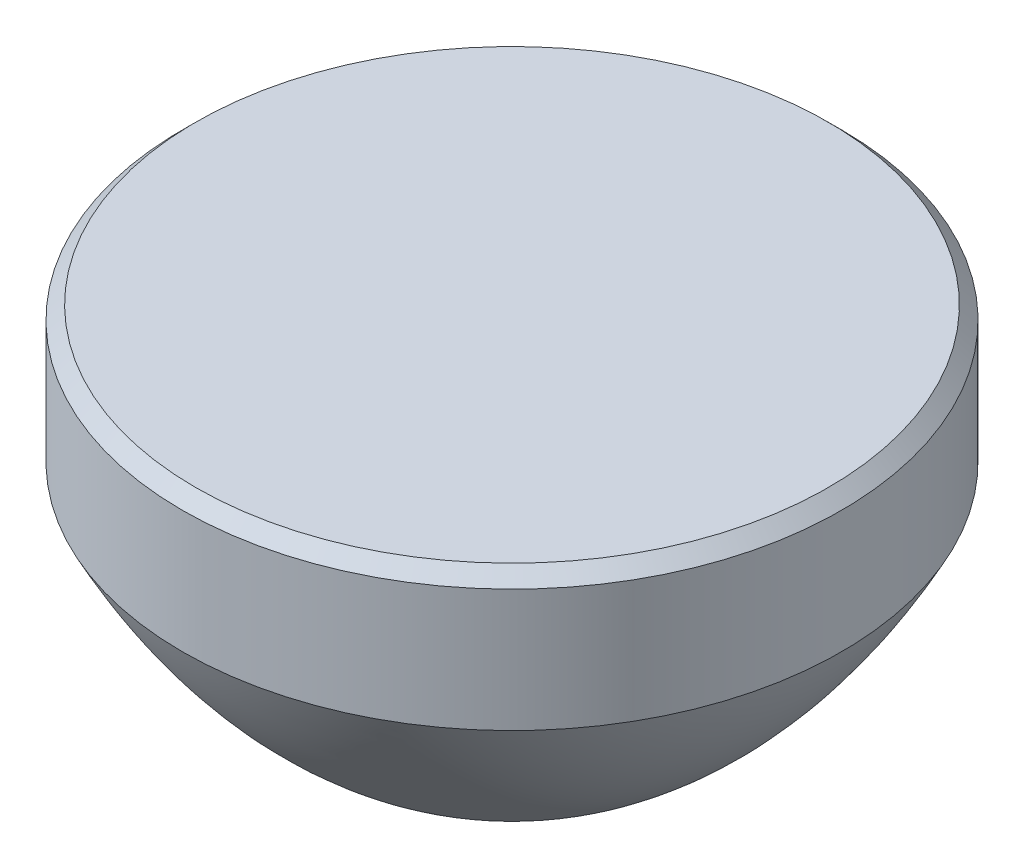
ISO-10303-21;
HEADER;
FILE_DESCRIPTION(('STEP AP214'),'2;1');
FILE_NAME('part.step','',(''),(''),'','','');
FILE_SCHEMA(('AUTOMOTIVE_DESIGN { 1 0 10303 214 1 1 1 1 }'));
ENDSEC;
DATA;
#1=APPLICATION_CONTEXT('core data for automotive mechanical design processes');
#2=APPLICATION_PROTOCOL_DEFINITION('international standard','automotive_design',2000,#1);
#3=PRODUCT_CONTEXT('',#1,'mechanical');
#4=PRODUCT('Part','Part','',(#3));
#5=PRODUCT_RELATED_PRODUCT_CATEGORY('part','',(#4));
#6=PRODUCT_DEFINITION_FORMATION('','',#4);
#7=PRODUCT_DEFINITION_CONTEXT('part definition',#1,'design');
#8=PRODUCT_DEFINITION('design','',#6,#7);
#9=PRODUCT_DEFINITION_SHAPE('','',#8);
#10=(LENGTH_UNIT() NAMED_UNIT(*) SI_UNIT(.MILLI.,.METRE.));
#11=(NAMED_UNIT(*) PLANE_ANGLE_UNIT() SI_UNIT($,.RADIAN.));
#12=(NAMED_UNIT(*) SI_UNIT($,.STERADIAN.) SOLID_ANGLE_UNIT());
#13=UNCERTAINTY_MEASURE_WITH_UNIT(LENGTH_MEASURE(1.E-05),#10,'distance_accuracy_value','');
#14=(GEOMETRIC_REPRESENTATION_CONTEXT(3) GLOBAL_UNCERTAINTY_ASSIGNED_CONTEXT((#13)) GLOBAL_UNIT_ASSIGNED_CONTEXT((#10,
#11,#12)) REPRESENTATION_CONTEXT('',''));
#15=CARTESIAN_POINT('',(0.,0.,0.));
#16=DIRECTION('',(0.,0.,1.));
#17=DIRECTION('',(1.,0.,0.));
#18=AXIS2_PLACEMENT_3D('',#15,#16,#17);
#19=CARTESIAN_POINT('',(0.,-2.9,0.));
#20=CARTESIAN_POINT('',(0.,-2.9,0.047771163554872));
#21=CARTESIAN_POINT('',(0.,-2.89849209528738,0.119832677684458));
#22=CARTESIAN_POINT('',(0.,-2.89346578990156,0.268426532367459));
#23=CARTESIAN_POINT('',(0.,-2.87992592184067,0.412434553279759));
#24=CARTESIAN_POINT('',(0.,-2.86041756065513,0.59354576037228));
#25=CARTESIAN_POINT('',(0.,-2.82904236431794,0.778868341411304));
#26=CARTESIAN_POINT('',(0.,-2.78161447398149,1.00389034921256));
#27=CARTESIAN_POINT('',(0.,-2.72292300141543,1.21782201166675));
#28=CARTESIAN_POINT('',(0.,-2.65334646240165,1.43336411531343));
#29=CARTESIAN_POINT('',(0.,-2.57329708391877,1.64230861469053));
#30=CARTESIAN_POINT('',(0.,-2.48325509982383,1.84889778409511));
#31=CARTESIAN_POINT('',(0.,-2.38368470455536,2.05001137937612));
#32=CARTESIAN_POINT('',(0.,-2.27514410985079,2.24703596465773));
#33=CARTESIAN_POINT('',(0.,-2.15807751142553,2.43877869041615));
#34=CARTESIAN_POINT('',(0.,-2.03313112887913,2.6256123202582));
#35=CARTESIAN_POINT('',(0.,-1.89224448805126,2.81865742006257));
#36=CARTESIAN_POINT('',(0.,-1.70857964405639,3.04954464069177));
#37=CARTESIAN_POINT('',(0.,-1.47533146881389,3.31278656640467));
#38=CARTESIAN_POINT('',(0.,-1.22739488274067,3.56117402073418));
#39=CARTESIAN_POINT('',(0.,-0.976185853238921,3.78718897928286));
#40=CARTESIAN_POINT('',(0.,-0.761332145445054,3.96629889805296));
#41=CARTESIAN_POINT('',(0.,-0.582742331207921,4.10606657833552));
#42=CARTESIAN_POINT('',(0.,-0.36097806646885,4.27160880502101));
#43=CARTESIAN_POINT('',(0.,-0.122943668397963,4.43481331641648));
#44=CARTESIAN_POINT('',(0.,0.10219728821653,4.58117593407208));
#45=CARTESIAN_POINT('',(0.,0.358696942203526,4.73423425094103));
#46=CARTESIAN_POINT('',(0.,0.526029168427437,4.83149914296394));
#47=CARTESIAN_POINT('',(0.,0.713916241579733,4.93283548258424));
#48=CARTESIAN_POINT('',(0.,0.799309135773187,4.97799387695552));
#49=CARTESIAN_POINT('',(0.,0.841709852713762,5.00000000000096));
#50=B_SPLINE_CURVE_WITH_KNOTS('',4,(#19,#20,#21,#22,#23,#24,#25,#26,#27,#28,#29,#30,#31,#32,#33,
#34,#35,#36,#37,#38,#39,#40,#41,#42,#43,#44,#45,#46,#47,#48,#49),.UNSPECIFIED.,.F.,.F.,(5,1,1,1,
1,1,1,1,1,1,1,1,1,1,1,1,1,1,1,1,1,1,1,1,1,1,1,5),(0.0648541245587119,0.0939274464039233,
0.108464104667884,0.123000762931845,0.152074093928852,0.181147410452886,0.210220714745704,
0.23929403000449,0.268367363288725,0.297440655355653,0.326513984002242,0.355587303660881,
0.384660605543354,0.413733898906283,0.442807212779115,0.471880576276969,0.508307684173329,
0.566454253417063,0.624600959988645,0.65367422681223,0.682747493635816,0.711820894025282,
0.740894294414747,0.799040815281995,0.828114175997417,0.857187536712839,0.886260897931253,
0.915334259149666),.UNSPECIFIED.);
#51=CARTESIAN_POINT('',(0.,-2.9,0.));
#52=DIRECTION('',(0.,-1.,0.));
#53=AXIS1_PLACEMENT('',#51,#52);
#54=SURFACE_OF_REVOLUTION('',#50,#53);
#55=CARTESIAN_POINT('',(0.,0.841709852713398,0.));
#56=DIRECTION('',(0.,-1.,0.));
#57=DIRECTION('',(0.,0.,-1.));
#58=AXIS2_PLACEMENT_3D('',#55,#56,#57);
#59=CIRCLE('',#58,5.0000000000014);
#60=CARTESIAN_POINT('',(0.,0.841709852713398,-5.0000000000014));
#61=VERTEX_POINT('',#60);
#62=EDGE_CURVE('E43',#61,#61,#59,.T.);
#63=ORIENTED_EDGE('',*,*,#62,.T.);
#64=EDGE_LOOP('',(#63));
#65=FACE_BOUND('',#64,.T.);
#66=CARTESIAN_POINT('',(0.,-2.9,0.));
#67=VERTEX_POINT('',#66);
#68=VERTEX_LOOP('',#67);
#69=FACE_BOUND('',#68,.T.);
#70=ADVANCED_FACE('F16',(#65,#69),#54,.F.);
#71=CARTESIAN_POINT('',(0.,2.9,5.0000000000014));
#72=DIRECTION('',(0.,1.,0.));
#73=DIRECTION('',(0.,0.,1.));
#74=AXIS2_PLACEMENT_3D('',#71,#72,#73);
#75=PLANE('',#74);
#76=CARTESIAN_POINT('',(0.,2.9,0.));
#77=DIRECTION('',(0.,1.,0.));
#78=DIRECTION('',(0.,0.,1.));
#79=AXIS2_PLACEMENT_3D('',#76,#77,#78);
#80=CIRCLE('',#79,4.8000000000014);
#81=CARTESIAN_POINT('',(0.,2.9,4.8000000000014));
#82=VERTEX_POINT('',#81);
#83=EDGE_CURVE('E11',#82,#82,#80,.T.);
#84=ORIENTED_EDGE('',*,*,#83,.T.);
#85=EDGE_LOOP('',(#84));
#86=FACE_BOUND('',#85,.T.);
#87=ADVANCED_FACE('F27',(#86),#75,.T.);
#88=CARTESIAN_POINT('',(0.,-2.9,0.));
#89=DIRECTION('',(0.,-1.,0.));
#90=DIRECTION('',(0.,0.,-1.));
#91=AXIS2_PLACEMENT_3D('',#88,#89,#90);
#92=CYLINDRICAL_SURFACE('',#91,5.0000000000014);
#93=CARTESIAN_POINT('',(0.,2.7,0.));
#94=DIRECTION('',(0.,1.,0.));
#95=DIRECTION('',(0.,0.,1.));
#96=AXIS2_PLACEMENT_3D('',#93,#94,#95);
#97=CIRCLE('',#96,5.0000000000014);
#98=CARTESIAN_POINT('',(0.,2.7,5.0000000000014));
#99=VERTEX_POINT('',#98);
#100=EDGE_CURVE('E23',#99,#99,#97,.F.);
#101=ORIENTED_EDGE('',*,*,#100,.T.);
#102=EDGE_LOOP('',(#101));
#103=FACE_BOUND('',#102,.T.);
#104=ORIENTED_EDGE('',*,*,#62,.F.);
#105=EDGE_LOOP('',(#104));
#106=FACE_BOUND('',#105,.T.);
#107=ADVANCED_FACE('F33',(#103,#106),#92,.T.);
#108=CARTESIAN_POINT('',(0.,2.7,0.));
#109=DIRECTION('',(0.,-1.,0.));
#110=DIRECTION('',(0.,0.,-1.));
#111=AXIS2_PLACEMENT_3D('',#108,#109,#110);
#112=CONICAL_SURFACE('',#111,5.0000000000014,0.785398163397448);
#113=ORIENTED_EDGE('',*,*,#83,.F.);
#114=EDGE_LOOP('',(#113));
#115=FACE_BOUND('',#114,.T.);
#116=ORIENTED_EDGE('',*,*,#100,.F.);
#117=EDGE_LOOP('',(#116));
#118=FACE_BOUND('',#117,.T.);
#119=ADVANCED_FACE('F18',(#115,#118),#112,.T.);
#120=CLOSED_SHELL('',(#70,#87,#107,#119));
#121=MANIFOLD_SOLID_BREP('B1',#120);
#122=ADVANCED_BREP_SHAPE_REPRESENTATION('',(#18,#121),#14);
#123=SHAPE_DEFINITION_REPRESENTATION(#9,#122);
ENDSEC;
END-ISO-10303-21;
